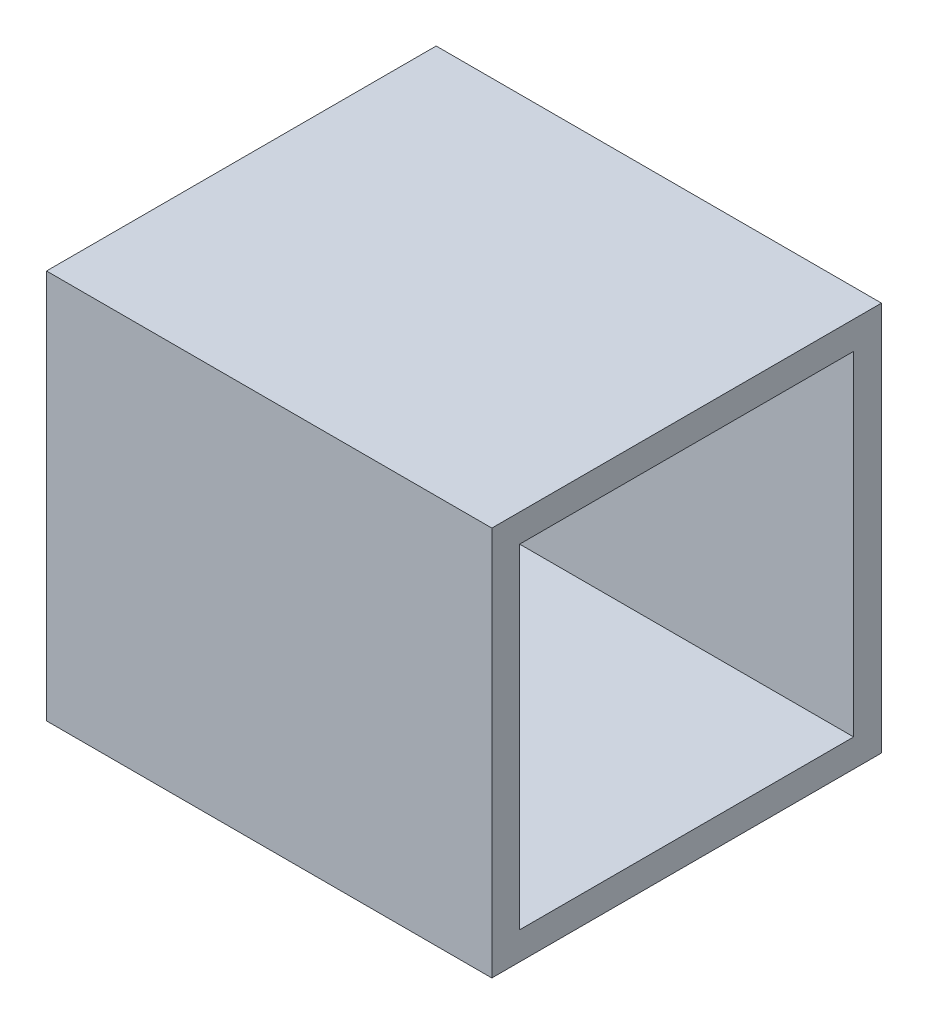
ISO-10303-21;
HEADER;
FILE_DESCRIPTION(('STEP AP214'),'2;1');
FILE_NAME('part.step','',(''),(''),'','','');
FILE_SCHEMA(('AUTOMOTIVE_DESIGN { 1 0 10303 214 1 1 1 1 }'));
ENDSEC;
DATA;
#1=APPLICATION_CONTEXT('core data for automotive mechanical design processes');
#2=APPLICATION_PROTOCOL_DEFINITION('international standard','automotive_design',2000,#1);
#3=PRODUCT_CONTEXT('',#1,'mechanical');
#4=PRODUCT('Part','Part','',(#3));
#5=PRODUCT_RELATED_PRODUCT_CATEGORY('part','',(#4));
#6=PRODUCT_DEFINITION_FORMATION('','',#4);
#7=PRODUCT_DEFINITION_CONTEXT('part definition',#1,'design');
#8=PRODUCT_DEFINITION('design','',#6,#7);
#9=PRODUCT_DEFINITION_SHAPE('','',#8);
#10=(LENGTH_UNIT() NAMED_UNIT(*) SI_UNIT(.MILLI.,.METRE.));
#11=(NAMED_UNIT(*) PLANE_ANGLE_UNIT() SI_UNIT($,.RADIAN.));
#12=(NAMED_UNIT(*) SI_UNIT($,.STERADIAN.) SOLID_ANGLE_UNIT());
#13=UNCERTAINTY_MEASURE_WITH_UNIT(LENGTH_MEASURE(1.E-05),#10,'distance_accuracy_value','');
#14=(GEOMETRIC_REPRESENTATION_CONTEXT(3) GLOBAL_UNCERTAINTY_ASSIGNED_CONTEXT((#13)) GLOBAL_UNIT_ASSIGNED_CONTEXT((#10,
#11,#12)) REPRESENTATION_CONTEXT('',''));
#15=CARTESIAN_POINT('',(0.,0.,0.));
#16=DIRECTION('',(0.,0.,1.));
#17=DIRECTION('',(1.,0.,0.));
#18=AXIS2_PLACEMENT_3D('',#15,#16,#17);
#19=CARTESIAN_POINT('',(0.,0.7,0.));
#20=DIRECTION('',(1.,0.,0.));
#21=DIRECTION('',(0.,0.,-1.));
#22=AXIS2_PLACEMENT_3D('',#19,#20,#21);
#23=PLANE('',#22);
#24=DIRECTION('',(0.,0.,1.));
#25=VECTOR('',#24,1.);
#26=CARTESIAN_POINT('',(0.,0.65,0.65));
#27=LINE('',#26,#25);
#28=CARTESIAN_POINT('',(0.,0.65,0.0500000000000002));
#29=VERTEX_POINT('',#28);
#30=CARTESIAN_POINT('',(0.,0.65,0.65));
#31=VERTEX_POINT('',#30);
#32=EDGE_CURVE('E116',#29,#31,#27,.T.);
#33=ORIENTED_EDGE('',*,*,#32,.T.);
#34=DIRECTION('',(0.,-1.,0.));
#35=VECTOR('',#34,1.);
#36=CARTESIAN_POINT('',(0.,0.65,0.65));
#37=LINE('',#36,#35);
#38=CARTESIAN_POINT('',(0.,0.05,0.65));
#39=VERTEX_POINT('',#38);
#40=EDGE_CURVE('E111',#31,#39,#37,.T.);
#41=ORIENTED_EDGE('',*,*,#40,.T.);
#42=DIRECTION('',(0.,0.,-1.));
#43=VECTOR('',#42,1.);
#44=CARTESIAN_POINT('',(0.,0.05,0.65));
#45=LINE('',#44,#43);
#46=CARTESIAN_POINT('',(0.,0.05,0.05));
#47=VERTEX_POINT('',#46);
#48=EDGE_CURVE('E119',#39,#47,#45,.T.);
#49=ORIENTED_EDGE('',*,*,#48,.T.);
#50=DIRECTION('',(0.,1.,0.));
#51=VECTOR('',#50,1.);
#52=CARTESIAN_POINT('',(0.,0.65,0.0500000000000002));
#53=LINE('',#52,#51);
#54=EDGE_CURVE('E58',#47,#29,#53,.T.);
#55=ORIENTED_EDGE('',*,*,#54,.T.);
#56=EDGE_LOOP('',(#33,#41,#49,#55));
#57=FACE_BOUND('',#56,.T.);
#58=DIRECTION('',(0.,0.,1.));
#59=VECTOR('',#58,1.);
#60=CARTESIAN_POINT('',(0.,0.,0.));
#61=LINE('',#60,#59);
#62=CARTESIAN_POINT('',(0.,0.,0.));
#63=VERTEX_POINT('',#62);
#64=CARTESIAN_POINT('',(0.,0.,0.7));
#65=VERTEX_POINT('',#64);
#66=EDGE_CURVE('E136',#63,#65,#61,.T.);
#67=ORIENTED_EDGE('',*,*,#66,.T.);
#68=DIRECTION('',(0.,-1.,0.));
#69=VECTOR('',#68,1.);
#70=CARTESIAN_POINT('',(0.,0.7,0.7));
#71=LINE('',#70,#69);
#72=CARTESIAN_POINT('',(0.,0.7,0.7));
#73=VERTEX_POINT('',#72);
#74=EDGE_CURVE('E180',#73,#65,#71,.T.);
#75=ORIENTED_EDGE('',*,*,#74,.F.);
#76=DIRECTION('',(0.,0.,1.));
#77=VECTOR('',#76,1.);
#78=CARTESIAN_POINT('',(0.,0.7,0.));
#79=LINE('',#78,#77);
#80=CARTESIAN_POINT('',(0.,0.7,0.));
#81=VERTEX_POINT('',#80);
#82=EDGE_CURVE('E143',#81,#73,#79,.T.);
#83=ORIENTED_EDGE('',*,*,#82,.F.);
#84=DIRECTION('',(0.,-1.,0.));
#85=VECTOR('',#84,1.);
#86=CARTESIAN_POINT('',(0.,0.7,0.));
#87=LINE('',#86,#85);
#88=EDGE_CURVE('E157',#81,#63,#87,.T.);
#89=ORIENTED_EDGE('',*,*,#88,.T.);
#90=EDGE_LOOP('',(#67,#75,#83,#89));
#91=FACE_BOUND('',#90,.T.);
#92=ADVANCED_FACE('F43',(#57,#91),#23,.F.);
#93=CARTESIAN_POINT('',(0.,0.7,0.7));
#94=DIRECTION('',(0.,0.,-1.));
#95=DIRECTION('',(-1.,0.,0.));
#96=AXIS2_PLACEMENT_3D('',#93,#94,#95);
#97=PLANE('',#96);
#98=DIRECTION('',(1.,0.,0.));
#99=VECTOR('',#98,1.);
#100=CARTESIAN_POINT('',(0.,0.,0.7));
#101=LINE('',#100,#99);
#102=CARTESIAN_POINT('',(0.8,0.,0.7));
#103=VERTEX_POINT('',#102);
#104=EDGE_CURVE('E161',#65,#103,#101,.T.);
#105=ORIENTED_EDGE('',*,*,#104,.T.);
#106=DIRECTION('',(0.,-1.,0.));
#107=VECTOR('',#106,1.);
#108=CARTESIAN_POINT('',(0.8,0.7,0.7));
#109=LINE('',#108,#107);
#110=CARTESIAN_POINT('',(0.8,0.7,0.7));
#111=VERTEX_POINT('',#110);
#112=EDGE_CURVE('E176',#111,#103,#109,.T.);
#113=ORIENTED_EDGE('',*,*,#112,.F.);
#114=DIRECTION('',(1.,0.,0.));
#115=VECTOR('',#114,1.);
#116=CARTESIAN_POINT('',(0.,0.7,0.7));
#117=LINE('',#116,#115);
#118=EDGE_CURVE('E147',#73,#111,#117,.T.);
#119=ORIENTED_EDGE('',*,*,#118,.F.);
#120=ORIENTED_EDGE('',*,*,#74,.T.);
#121=EDGE_LOOP('',(#105,#113,#119,#120));
#122=FACE_BOUND('',#121,.T.);
#123=ADVANCED_FACE('F207',(#122),#97,.F.);
#124=CARTESIAN_POINT('',(0.8,0.7,0.));
#125=DIRECTION('',(-1.,0.,0.));
#126=DIRECTION('',(0.,0.,1.));
#127=AXIS2_PLACEMENT_3D('',#124,#125,#126);
#128=PLANE('',#127);
#129=DIRECTION('',(0.,0.,1.));
#130=VECTOR('',#129,1.);
#131=CARTESIAN_POINT('',(0.8,0.05,0.));
#132=LINE('',#131,#130);
#133=CARTESIAN_POINT('',(0.8,0.05,0.05));
#134=VERTEX_POINT('',#133);
#135=CARTESIAN_POINT('',(0.8,0.05,0.65));
#136=VERTEX_POINT('',#135);
#137=EDGE_CURVE('E184',#134,#136,#132,.T.);
#138=ORIENTED_EDGE('',*,*,#137,.T.);
#139=DIRECTION('',(0.,1.,0.));
#140=VECTOR('',#139,1.);
#141=CARTESIAN_POINT('',(0.8,0.7,0.65));
#142=LINE('',#141,#140);
#143=CARTESIAN_POINT('',(0.8,0.65,0.65));
#144=VERTEX_POINT('',#143);
#145=EDGE_CURVE('E11',#136,#144,#142,.T.);
#146=ORIENTED_EDGE('',*,*,#145,.T.);
#147=DIRECTION('',(0.,0.,-1.));
#148=VECTOR('',#147,1.);
#149=CARTESIAN_POINT('',(0.8,0.65,0.));
#150=LINE('',#149,#148);
#151=CARTESIAN_POINT('',(0.8,0.65,0.05));
#152=VERTEX_POINT('',#151);
#153=EDGE_CURVE('E51',#144,#152,#150,.T.);
#154=ORIENTED_EDGE('',*,*,#153,.T.);
#155=DIRECTION('',(0.,-1.,0.));
#156=VECTOR('',#155,1.);
#157=CARTESIAN_POINT('',(0.8,0.7,0.05));
#158=LINE('',#157,#156);
#159=EDGE_CURVE('E187',#152,#134,#158,.T.);
#160=ORIENTED_EDGE('',*,*,#159,.T.);
#161=EDGE_LOOP('',(#138,#146,#154,#160));
#162=FACE_BOUND('',#161,.T.);
#163=DIRECTION('',(0.,0.,-1.));
#164=VECTOR('',#163,1.);
#165=CARTESIAN_POINT('',(0.8,0.,0.));
#166=LINE('',#165,#164);
#167=CARTESIAN_POINT('',(0.8,0.,0.));
#168=VERTEX_POINT('',#167);
#169=EDGE_CURVE('E164',#103,#168,#166,.T.);
#170=ORIENTED_EDGE('',*,*,#169,.T.);
#171=DIRECTION('',(0.,-1.,0.));
#172=VECTOR('',#171,1.);
#173=CARTESIAN_POINT('',(0.8,0.7,0.));
#174=LINE('',#173,#172);
#175=CARTESIAN_POINT('',(0.8,0.7,0.));
#176=VERTEX_POINT('',#175);
#177=EDGE_CURVE('E172',#176,#168,#174,.T.);
#178=ORIENTED_EDGE('',*,*,#177,.F.);
#179=DIRECTION('',(0.,0.,-1.));
#180=VECTOR('',#179,1.);
#181=CARTESIAN_POINT('',(0.8,0.7,0.));
#182=LINE('',#181,#180);
#183=EDGE_CURVE('E151',#111,#176,#182,.T.);
#184=ORIENTED_EDGE('',*,*,#183,.F.);
#185=ORIENTED_EDGE('',*,*,#112,.T.);
#186=EDGE_LOOP('',(#170,#178,#184,#185));
#187=FACE_BOUND('',#186,.T.);
#188=ADVANCED_FACE('F193',(#162,#187),#128,.F.);
#189=CARTESIAN_POINT('',(0.,0.7,0.));
#190=DIRECTION('',(0.,0.,1.));
#191=DIRECTION('',(1.,0.,0.));
#192=AXIS2_PLACEMENT_3D('',#189,#190,#191);
#193=PLANE('',#192);
#194=DIRECTION('',(-1.,0.,0.));
#195=VECTOR('',#194,1.);
#196=CARTESIAN_POINT('',(0.,0.,0.));
#197=LINE('',#196,#195);
#198=EDGE_CURVE('E148',#168,#63,#197,.T.);
#199=ORIENTED_EDGE('',*,*,#198,.T.);
#200=ORIENTED_EDGE('',*,*,#88,.F.);
#201=DIRECTION('',(-1.,0.,0.));
#202=VECTOR('',#201,1.);
#203=CARTESIAN_POINT('',(0.,0.7,0.));
#204=LINE('',#203,#202);
#205=EDGE_CURVE('E154',#176,#81,#204,.T.);
#206=ORIENTED_EDGE('',*,*,#205,.F.);
#207=ORIENTED_EDGE('',*,*,#177,.T.);
#208=EDGE_LOOP('',(#199,#200,#206,#207));
#209=FACE_BOUND('',#208,.T.);
#210=ADVANCED_FACE('F215',(#209),#193,.F.);
#211=CARTESIAN_POINT('',(0.,0.7,0.));
#212=DIRECTION('',(0.,1.,0.));
#213=DIRECTION('',(0.,0.,1.));
#214=AXIS2_PLACEMENT_3D('',#211,#212,#213);
#215=PLANE('',#214);
#216=ORIENTED_EDGE('',*,*,#82,.T.);
#217=ORIENTED_EDGE('',*,*,#118,.T.);
#218=ORIENTED_EDGE('',*,*,#183,.T.);
#219=ORIENTED_EDGE('',*,*,#205,.T.);
#220=EDGE_LOOP('',(#216,#217,#218,#219));
#221=FACE_BOUND('',#220,.T.);
#222=ADVANCED_FACE('F220',(#221),#215,.T.);
#223=CARTESIAN_POINT('',(0.,0.,0.));
#224=DIRECTION('',(0.,1.,0.));
#225=DIRECTION('',(0.,0.,1.));
#226=AXIS2_PLACEMENT_3D('',#223,#224,#225);
#227=PLANE('',#226);
#228=ORIENTED_EDGE('',*,*,#66,.F.);
#229=ORIENTED_EDGE('',*,*,#198,.F.);
#230=ORIENTED_EDGE('',*,*,#169,.F.);
#231=ORIENTED_EDGE('',*,*,#104,.F.);
#232=EDGE_LOOP('',(#228,#229,#230,#231));
#233=FACE_BOUND('',#232,.T.);
#234=ADVANCED_FACE('F222',(#233),#227,.F.);
#235=CARTESIAN_POINT('',(0.,0.65,0.65));
#236=DIRECTION('',(0.,0.,1.));
#237=DIRECTION('',(1.,0.,0.));
#238=AXIS2_PLACEMENT_3D('',#235,#236,#237);
#239=PLANE('',#238);
#240=DIRECTION('',(1.,0.,0.));
#241=VECTOR('',#240,1.);
#242=CARTESIAN_POINT('',(0.,0.05,0.65));
#243=LINE('',#242,#241);
#244=EDGE_CURVE('E66',#39,#136,#243,.T.);
#245=ORIENTED_EDGE('',*,*,#244,.F.);
#246=ORIENTED_EDGE('',*,*,#40,.F.);
#247=DIRECTION('',(1.,0.,0.));
#248=VECTOR('',#247,1.);
#249=CARTESIAN_POINT('',(0.,0.65,0.65));
#250=LINE('',#249,#248);
#251=EDGE_CURVE('E133',#31,#144,#250,.T.);
#252=ORIENTED_EDGE('',*,*,#251,.T.);
#253=ORIENTED_EDGE('',*,*,#145,.F.);
#254=EDGE_LOOP('',(#245,#246,#252,#253));
#255=FACE_BOUND('',#254,.T.);
#256=ADVANCED_FACE('F108',(#255),#239,.F.);
#257=CARTESIAN_POINT('',(0.,0.65,0.65));
#258=DIRECTION('',(0.,1.,0.));
#259=DIRECTION('',(0.,0.,1.));
#260=AXIS2_PLACEMENT_3D('',#257,#258,#259);
#261=PLANE('',#260);
#262=ORIENTED_EDGE('',*,*,#251,.F.);
#263=ORIENTED_EDGE('',*,*,#32,.F.);
#264=DIRECTION('',(1.,0.,0.));
#265=VECTOR('',#264,1.);
#266=CARTESIAN_POINT('',(0.,0.65,0.0500000000000002));
#267=LINE('',#266,#265);
#268=EDGE_CURVE('E137',#29,#152,#267,.T.);
#269=ORIENTED_EDGE('',*,*,#268,.T.);
#270=ORIENTED_EDGE('',*,*,#153,.F.);
#271=EDGE_LOOP('',(#262,#263,#269,#270));
#272=FACE_BOUND('',#271,.T.);
#273=ADVANCED_FACE('F196',(#272),#261,.F.);
#274=CARTESIAN_POINT('',(0.,0.65,0.0500000000000002));
#275=DIRECTION('',(0.,0.,-1.));
#276=DIRECTION('',(-1.,0.,0.));
#277=AXIS2_PLACEMENT_3D('',#274,#275,#276);
#278=PLANE('',#277);
#279=ORIENTED_EDGE('',*,*,#268,.F.);
#280=ORIENTED_EDGE('',*,*,#54,.F.);
#281=DIRECTION('',(1.,0.,0.));
#282=VECTOR('',#281,1.);
#283=CARTESIAN_POINT('',(0.,0.05,0.0500000000000002));
#284=LINE('',#283,#282);
#285=EDGE_CURVE('E115',#47,#134,#284,.T.);
#286=ORIENTED_EDGE('',*,*,#285,.T.);
#287=ORIENTED_EDGE('',*,*,#159,.F.);
#288=EDGE_LOOP('',(#279,#280,#286,#287));
#289=FACE_BOUND('',#288,.T.);
#290=ADVANCED_FACE('F197',(#289),#278,.F.);
#291=CARTESIAN_POINT('',(0.,0.05,0.65));
#292=DIRECTION('',(0.,-1.,0.));
#293=DIRECTION('',(0.,0.,-1.));
#294=AXIS2_PLACEMENT_3D('',#291,#292,#293);
#295=PLANE('',#294);
#296=ORIENTED_EDGE('',*,*,#285,.F.);
#297=ORIENTED_EDGE('',*,*,#48,.F.);
#298=ORIENTED_EDGE('',*,*,#244,.T.);
#299=ORIENTED_EDGE('',*,*,#137,.F.);
#300=EDGE_LOOP('',(#296,#297,#298,#299));
#301=FACE_BOUND('',#300,.T.);
#302=ADVANCED_FACE('F120',(#301),#295,.F.);
#303=CLOSED_SHELL('',(#92,#123,#188,#210,#222,#234,#256,#273,#290,#302));
#304=MANIFOLD_SOLID_BREP('B2',#303);
#305=ADVANCED_BREP_SHAPE_REPRESENTATION('',(#18,#304),#14);
#306=SHAPE_DEFINITION_REPRESENTATION(#9,#305);
ENDSEC;
END-ISO-10303-21;
